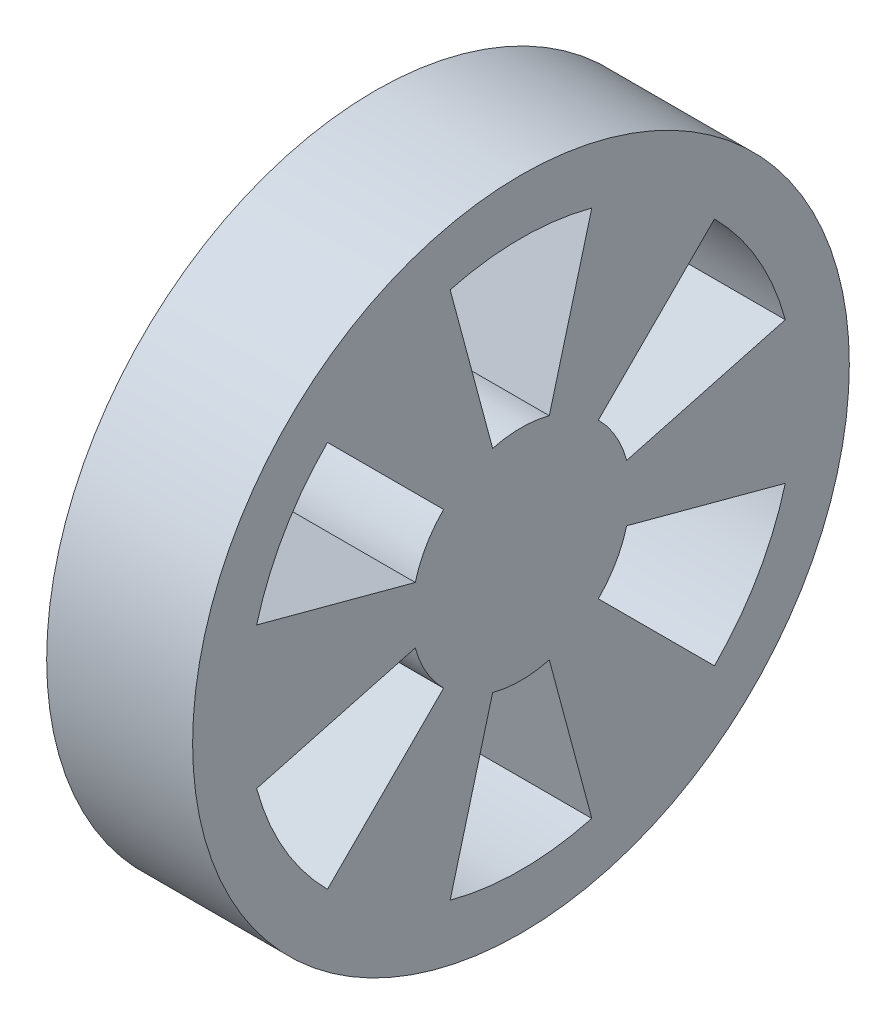
ISO-10303-21;
HEADER;
FILE_DESCRIPTION(('STEP AP214'),'2;1');
FILE_NAME('part.step','',(''),(''),'','','');
FILE_SCHEMA(('AUTOMOTIVE_DESIGN { 1 0 10303 214 1 1 1 1 }'));
ENDSEC;
DATA;
#1=APPLICATION_CONTEXT('core data for automotive mechanical design processes');
#2=APPLICATION_PROTOCOL_DEFINITION('international standard','automotive_design',2000,#1);
#3=PRODUCT_CONTEXT('',#1,'mechanical');
#4=PRODUCT('Part','Part','',(#3));
#5=PRODUCT_RELATED_PRODUCT_CATEGORY('part','',(#4));
#6=PRODUCT_DEFINITION_FORMATION('','',#4);
#7=PRODUCT_DEFINITION_CONTEXT('part definition',#1,'design');
#8=PRODUCT_DEFINITION('design','',#6,#7);
#9=PRODUCT_DEFINITION_SHAPE('','',#8);
#10=(LENGTH_UNIT() NAMED_UNIT(*) SI_UNIT(.MILLI.,.METRE.));
#11=(NAMED_UNIT(*) PLANE_ANGLE_UNIT() SI_UNIT($,.RADIAN.));
#12=(NAMED_UNIT(*) SI_UNIT($,.STERADIAN.) SOLID_ANGLE_UNIT());
#13=UNCERTAINTY_MEASURE_WITH_UNIT(LENGTH_MEASURE(1.E-05),#10,'distance_accuracy_value','');
#14=(GEOMETRIC_REPRESENTATION_CONTEXT(3) GLOBAL_UNCERTAINTY_ASSIGNED_CONTEXT((#13)) GLOBAL_UNIT_ASSIGNED_CONTEXT((#10,
#11,#12)) REPRESENTATION_CONTEXT('',''));
#15=CARTESIAN_POINT('',(0.,0.,0.));
#16=DIRECTION('',(0.,0.,1.));
#17=DIRECTION('',(1.,0.,0.));
#18=AXIS2_PLACEMENT_3D('',#15,#16,#17);
#19=CARTESIAN_POINT('',(20.,0.,0.));
#20=DIRECTION('',(-1.,0.,0.));
#21=DIRECTION('',(0.,0.,1.));
#22=AXIS2_PLACEMENT_3D('',#19,#20,#21);
#23=CYLINDRICAL_SURFACE('',#22,10.);
#24=CARTESIAN_POINT('',(20.,0.,0.));
#25=DIRECTION('',(1.,0.,0.));
#26=DIRECTION('',(0.,0.,-1.));
#27=AXIS2_PLACEMENT_3D('',#24,#25,#26);
#28=CIRCLE('',#27,10.);
#29=CARTESIAN_POINT('',(20.,0.,-10.));
#30=VERTEX_POINT('',#29);
#31=EDGE_CURVE('E11',#30,#30,#28,.T.);
#32=ORIENTED_EDGE('',*,*,#31,.F.);
#33=EDGE_LOOP('',(#32));
#34=FACE_BOUND('',#33,.T.);
#35=CARTESIAN_POINT('',(0.,0.,0.));
#36=DIRECTION('',(1.,0.,0.));
#37=DIRECTION('',(0.,0.,-1.));
#38=AXIS2_PLACEMENT_3D('',#35,#36,#37);
#39=CIRCLE('',#38,10.);
#40=CARTESIAN_POINT('',(0.,0.,-10.));
#41=VERTEX_POINT('',#40);
#42=EDGE_CURVE('E44',#41,#41,#39,.T.);
#43=ORIENTED_EDGE('',*,*,#42,.T.);
#44=EDGE_LOOP('',(#43));
#45=FACE_BOUND('',#44,.T.);
#46=ADVANCED_FACE('F41',(#34,#45),#23,.T.);
#47=CARTESIAN_POINT('',(0.,0.,0.));
#48=DIRECTION('',(1.,0.,0.));
#49=DIRECTION('',(0.,0.,-1.));
#50=AXIS2_PLACEMENT_3D('',#47,#48,#49);
#51=PLANE('',#50);
#52=ORIENTED_EDGE('',*,*,#42,.F.);
#53=EDGE_LOOP('',(#52));
#54=FACE_BOUND('',#53,.T.);
#55=ADVANCED_FACE('F502',(#54),#51,.F.);
#56=CARTESIAN_POINT('',(40.,0.,0.));
#57=DIRECTION('',(-1.,0.,0.));
#58=DIRECTION('',(0.,0.,1.));
#59=AXIS2_PLACEMENT_3D('',#56,#57,#58);
#60=CYLINDRICAL_SURFACE('',#59,45.);
#61=CARTESIAN_POINT('',(40.,0.,0.));
#62=DIRECTION('',(1.,0.,0.));
#63=DIRECTION('',(0.,0.,-1.));
#64=AXIS2_PLACEMENT_3D('',#61,#62,#63);
#65=CIRCLE('',#64,45.);
#66=CARTESIAN_POINT('',(40.,0.,-45.));
#67=VERTEX_POINT('',#66);
#68=EDGE_CURVE('E474',#67,#67,#65,.T.);
#69=ORIENTED_EDGE('',*,*,#68,.F.);
#70=EDGE_LOOP('',(#69));
#71=FACE_BOUND('',#70,.T.);
#72=CARTESIAN_POINT('',(20.,0.,0.));
#73=DIRECTION('',(1.,0.,0.));
#74=DIRECTION('',(0.,0.,-1.));
#75=AXIS2_PLACEMENT_3D('',#72,#73,#74);
#76=CIRCLE('',#75,45.);
#77=CARTESIAN_POINT('',(20.,0.,-45.));
#78=VERTEX_POINT('',#77);
#79=EDGE_CURVE('E464',#78,#78,#76,.T.);
#80=ORIENTED_EDGE('',*,*,#79,.T.);
#81=EDGE_LOOP('',(#80));
#82=FACE_BOUND('',#81,.T.);
#83=ADVANCED_FACE('F482',(#71,#82),#60,.T.);
#84=CARTESIAN_POINT('',(40.,0.,0.));
#85=DIRECTION('',(1.,0.,0.));
#86=DIRECTION('',(0.,0.,-1.));
#87=AXIS2_PLACEMENT_3D('',#84,#85,#86);
#88=PLANE('',#87);
#89=CARTESIAN_POINT('',(40.,0.,0.));
#90=DIRECTION('',(1.,0.,0.));
#91=DIRECTION('',(0.,0.,1.));
#92=AXIS2_PLACEMENT_3D('',#89,#90,#91);
#93=CIRCLE('',#92,15.);
#94=CARTESIAN_POINT('',(40.,10.6066017177982,10.6066017177982));
#95=VERTEX_POINT('',#94);
#96=CARTESIAN_POINT('',(40.,3.88228567653776,14.488887394336));
#97=VERTEX_POINT('',#96);
#98=EDGE_CURVE('E258',#95,#97,#93,.T.);
#99=ORIENTED_EDGE('',*,*,#98,.T.);
#100=DIRECTION('',(0.,0.258819045102518,0.965925826289069));
#101=VECTOR('',#100,1.);
#102=CARTESIAN_POINT('',(40.,9.70571419134441,36.2222184858401));
#103=LINE('',#102,#101);
#104=CARTESIAN_POINT('',(40.,9.70571419134441,36.2222184858401));
#105=VERTEX_POINT('',#104);
#106=EDGE_CURVE('E262',#97,#105,#103,.T.);
#107=ORIENTED_EDGE('',*,*,#106,.T.);
#108=CARTESIAN_POINT('',(40.,0.,0.));
#109=DIRECTION('',(-1.,0.,0.));
#110=DIRECTION('',(0.,0.,1.));
#111=AXIS2_PLACEMENT_3D('',#108,#109,#110);
#112=CIRCLE('',#111,37.5);
#113=CARTESIAN_POINT('',(40.,26.5165042944955,26.5165042944956));
#114=VERTEX_POINT('',#113);
#115=EDGE_CURVE('E56',#105,#114,#112,.T.);
#116=ORIENTED_EDGE('',*,*,#115,.T.);
#117=DIRECTION('',(0.,-0.707106781186547,-0.707106781186548));
#118=VECTOR('',#117,1.);
#119=CARTESIAN_POINT('',(40.,26.5165042944955,26.5165042944956));
#120=LINE('',#119,#118);
#121=EDGE_CURVE('E269',#114,#95,#120,.T.);
#122=ORIENTED_EDGE('',*,*,#121,.T.);
#123=EDGE_LOOP('',(#99,#107,#116,#122));
#124=FACE_BOUND('',#123,.T.);
#125=CARTESIAN_POINT('',(40.,0.,0.));
#126=DIRECTION('',(1.,0.,0.));
#127=DIRECTION('',(0.,0.,1.));
#128=AXIS2_PLACEMENT_3D('',#125,#126,#127);
#129=CIRCLE('',#128,15.);
#130=CARTESIAN_POINT('',(40.,-3.88228567653787,14.488887394336));
#131=VERTEX_POINT('',#130);
#132=CARTESIAN_POINT('',(40.,-10.6066017177983,10.6066017177982));
#133=VERTEX_POINT('',#132);
#134=EDGE_CURVE('E302',#131,#133,#129,.T.);
#135=ORIENTED_EDGE('',*,*,#134,.T.);
#136=DIRECTION('',(0.,-0.707106781186552,0.707106781186543));
#137=VECTOR('',#136,1.);
#138=CARTESIAN_POINT('',(40.,-26.5165042944957,26.5165042944954));
#139=LINE('',#138,#137);
#140=CARTESIAN_POINT('',(40.,-26.5165042944957,26.5165042944954));
#141=VERTEX_POINT('',#140);
#142=EDGE_CURVE('E306',#133,#141,#139,.T.);
#143=ORIENTED_EDGE('',*,*,#142,.T.);
#144=CARTESIAN_POINT('',(40.,0.,0.));
#145=DIRECTION('',(-1.,0.,0.));
#146=DIRECTION('',(0.,0.,1.));
#147=AXIS2_PLACEMENT_3D('',#144,#145,#146);
#148=CIRCLE('',#147,37.5);
#149=CARTESIAN_POINT('',(40.,-9.70571419134466,36.22221848584));
#150=VERTEX_POINT('',#149);
#151=EDGE_CURVE('E64',#141,#150,#148,.T.);
#152=ORIENTED_EDGE('',*,*,#151,.T.);
#153=DIRECTION('',(0.,0.258819045102524,-0.965925826289067));
#154=VECTOR('',#153,1.);
#155=CARTESIAN_POINT('',(40.,-9.70571419134466,36.22221848584));
#156=LINE('',#155,#154);
#157=EDGE_CURVE('E313',#150,#131,#156,.T.);
#158=ORIENTED_EDGE('',*,*,#157,.T.);
#159=EDGE_LOOP('',(#135,#143,#152,#158));
#160=FACE_BOUND('',#159,.T.);
#161=CARTESIAN_POINT('',(40.,0.,0.));
#162=DIRECTION('',(1.,0.,0.));
#163=DIRECTION('',(0.,0.,1.));
#164=AXIS2_PLACEMENT_3D('',#161,#162,#163);
#165=CIRCLE('',#164,15.);
#166=CARTESIAN_POINT('',(40.,-14.488887394336,3.88228567653772));
#167=VERTEX_POINT('',#166);
#168=CARTESIAN_POINT('',(40.,-14.488887394336,-3.88228567653793));
#169=VERTEX_POINT('',#168);
#170=EDGE_CURVE('E344',#167,#169,#165,.T.);
#171=ORIENTED_EDGE('',*,*,#170,.T.);
#172=DIRECTION('',(0.,-0.965925826289066,-0.258819045102529));
#173=VECTOR('',#172,1.);
#174=CARTESIAN_POINT('',(40.,-36.22221848584,-9.70571419134482));
#175=LINE('',#174,#173);
#176=CARTESIAN_POINT('',(40.,-36.22221848584,-9.70571419134482));
#177=VERTEX_POINT('',#176);
#178=EDGE_CURVE('E348',#169,#177,#175,.T.);
#179=ORIENTED_EDGE('',*,*,#178,.T.);
#180=CARTESIAN_POINT('',(40.,0.,0.));
#181=DIRECTION('',(-1.,0.,0.));
#182=DIRECTION('',(0.,0.,1.));
#183=AXIS2_PLACEMENT_3D('',#180,#181,#182);
#184=CIRCLE('',#183,37.5);
#185=CARTESIAN_POINT('',(40.,-36.2222184858401,9.70571419134432));
#186=VERTEX_POINT('',#185);
#187=EDGE_CURVE('E353',#177,#186,#184,.T.);
#188=ORIENTED_EDGE('',*,*,#187,.T.);
#189=DIRECTION('',(0.,0.96592582628907,-0.258819045102515));
#190=VECTOR('',#189,1.);
#191=CARTESIAN_POINT('',(40.,-36.2222184858401,9.70571419134431));
#192=LINE('',#191,#190);
#193=EDGE_CURVE('E357',#186,#167,#192,.T.);
#194=ORIENTED_EDGE('',*,*,#193,.T.);
#195=EDGE_LOOP('',(#171,#179,#188,#194));
#196=FACE_BOUND('',#195,.T.);
#197=CARTESIAN_POINT('',(40.,0.,0.));
#198=DIRECTION('',(1.,0.,0.));
#199=DIRECTION('',(0.,0.,1.));
#200=AXIS2_PLACEMENT_3D('',#197,#198,#199);
#201=CIRCLE('',#200,15.);
#202=CARTESIAN_POINT('',(40.,-10.6066017177981,-10.6066017177983));
#203=VERTEX_POINT('',#202);
#204=CARTESIAN_POINT('',(40.,-3.88228567653766,-14.4888873943361));
#205=VERTEX_POINT('',#204);
#206=EDGE_CURVE('E388',#203,#205,#201,.T.);
#207=ORIENTED_EDGE('',*,*,#206,.T.);
#208=DIRECTION('',(0.,-0.258819045102511,-0.965925826289071));
#209=VECTOR('',#208,1.);
#210=CARTESIAN_POINT('',(40.,-9.70571419134416,-36.2222184858402));
#211=LINE('',#210,#209);
#212=CARTESIAN_POINT('',(40.,-9.70571419134416,-36.2222184858402));
#213=VERTEX_POINT('',#212);
#214=EDGE_CURVE('E392',#205,#213,#211,.T.);
#215=ORIENTED_EDGE('',*,*,#214,.T.);
#216=CARTESIAN_POINT('',(40.,0.,0.));
#217=DIRECTION('',(-1.,0.,0.));
#218=DIRECTION('',(0.,0.,1.));
#219=AXIS2_PLACEMENT_3D('',#216,#217,#218);
#220=CIRCLE('',#219,37.5);
#221=CARTESIAN_POINT('',(40.,-26.5165042944953,-26.5165042944958));
#222=VERTEX_POINT('',#221);
#223=EDGE_CURVE('E397',#213,#222,#220,.T.);
#224=ORIENTED_EDGE('',*,*,#223,.T.);
#225=DIRECTION('',(0.,0.707106781186542,0.707106781186553));
#226=VECTOR('',#225,1.);
#227=CARTESIAN_POINT('',(40.,-26.5165042944953,-26.5165042944957));
#228=LINE('',#227,#226);
#229=EDGE_CURVE('E401',#222,#203,#228,.T.);
#230=ORIENTED_EDGE('',*,*,#229,.T.);
#231=EDGE_LOOP('',(#207,#215,#224,#230));
#232=FACE_BOUND('',#231,.T.);
#233=CARTESIAN_POINT('',(40.,0.,0.));
#234=DIRECTION('',(1.,0.,0.));
#235=DIRECTION('',(0.,0.,1.));
#236=AXIS2_PLACEMENT_3D('',#233,#234,#235);
#237=CIRCLE('',#236,15.);
#238=CARTESIAN_POINT('',(40.,3.88228567653797,-14.488887394336));
#239=VERTEX_POINT('',#238);
#240=CARTESIAN_POINT('',(40.,10.6066017177983,-10.6066017177981));
#241=VERTEX_POINT('',#240);
#242=EDGE_CURVE('E206',#239,#241,#237,.T.);
#243=ORIENTED_EDGE('',*,*,#242,.T.);
#244=DIRECTION('',(0.,0.707106781186557,-0.707106781186538));
#245=VECTOR('',#244,1.);
#246=CARTESIAN_POINT('',(40.,26.5165042944959,-26.5165042944952));
#247=LINE('',#246,#245);
#248=CARTESIAN_POINT('',(40.,26.5165042944959,-26.5165042944952));
#249=VERTEX_POINT('',#248);
#250=EDGE_CURVE('E219',#241,#249,#247,.T.);
#251=ORIENTED_EDGE('',*,*,#250,.T.);
#252=CARTESIAN_POINT('',(40.,0.,0.));
#253=DIRECTION('',(-1.,0.,0.));
#254=DIRECTION('',(0.,0.,1.));
#255=AXIS2_PLACEMENT_3D('',#252,#253,#254);
#256=CIRCLE('',#255,37.5);
#257=CARTESIAN_POINT('',(40.,9.70571419134491,-36.22221848584));
#258=VERTEX_POINT('',#257);
#259=EDGE_CURVE('E224',#249,#258,#256,.T.);
#260=ORIENTED_EDGE('',*,*,#259,.T.);
#261=DIRECTION('',(0.,-0.258819045102531,0.965925826289065));
#262=VECTOR('',#261,1.);
#263=CARTESIAN_POINT('',(40.,9.70571419134491,-36.22221848584));
#264=LINE('',#263,#262);
#265=EDGE_CURVE('E215',#258,#239,#264,.T.);
#266=ORIENTED_EDGE('',*,*,#265,.T.);
#267=EDGE_LOOP('',(#243,#251,#260,#266));
#268=FACE_BOUND('',#267,.T.);
#269=CARTESIAN_POINT('',(40.,0.,0.));
#270=DIRECTION('',(1.,0.,0.));
#271=DIRECTION('',(0.,0.,1.));
#272=AXIS2_PLACEMENT_3D('',#269,#270,#271);
#273=CIRCLE('',#272,15.);
#274=CARTESIAN_POINT('',(40.,14.488887394336,-3.88228567653782));
#275=VERTEX_POINT('',#274);
#276=CARTESIAN_POINT('',(40.,14.488887394336,3.88228567653782));
#277=VERTEX_POINT('',#276);
#278=EDGE_CURVE('E430',#275,#277,#273,.T.);
#279=ORIENTED_EDGE('',*,*,#278,.T.);
#280=DIRECTION('',(0.,0.965925826289068,0.258819045102522));
#281=VECTOR('',#280,1.);
#282=CARTESIAN_POINT('',(40.,36.2222184858401,9.70571419134456));
#283=LINE('',#282,#281);
#284=CARTESIAN_POINT('',(40.,36.2222184858401,9.70571419134456));
#285=VERTEX_POINT('',#284);
#286=EDGE_CURVE('E434',#277,#285,#283,.T.);
#287=ORIENTED_EDGE('',*,*,#286,.T.);
#288=CARTESIAN_POINT('',(40.,0.,0.));
#289=DIRECTION('',(-1.,0.,0.));
#290=DIRECTION('',(0.,0.,1.));
#291=AXIS2_PLACEMENT_3D('',#288,#289,#290);
#292=CIRCLE('',#291,37.5);
#293=CARTESIAN_POINT('',(40.,36.2222184858401,-9.70571419134456));
#294=VERTEX_POINT('',#293);
#295=EDGE_CURVE('E439',#285,#294,#292,.T.);
#296=ORIENTED_EDGE('',*,*,#295,.T.);
#297=DIRECTION('',(0.,-0.965925826289068,0.258819045102522));
#298=VECTOR('',#297,1.);
#299=CARTESIAN_POINT('',(40.,36.2222184858401,-9.70571419134456));
#300=LINE('',#299,#298);
#301=EDGE_CURVE('E443',#294,#275,#300,.T.);
#302=ORIENTED_EDGE('',*,*,#301,.T.);
#303=EDGE_LOOP('',(#279,#287,#296,#302));
#304=FACE_BOUND('',#303,.T.);
#305=ORIENTED_EDGE('',*,*,#68,.T.);
#306=EDGE_LOOP('',(#305));
#307=FACE_BOUND('',#306,.T.);
#308=ADVANCED_FACE('F226',(#124,#160,#196,#232,#268,#304,#307),#88,.T.);
#309=CARTESIAN_POINT('',(20.,0.,0.));
#310=DIRECTION('',(1.,0.,0.));
#311=DIRECTION('',(0.,0.,-1.));
#312=AXIS2_PLACEMENT_3D('',#309,#310,#311);
#313=PLANE('',#312);
#314=DIRECTION('',(0.,0.258819045102518,0.965925826289069));
#315=VECTOR('',#314,1.);
#316=CARTESIAN_POINT('',(20.,9.70571419134441,36.2222184858401));
#317=LINE('',#316,#315);
#318=CARTESIAN_POINT('',(20.,3.88228567653776,14.488887394336));
#319=VERTEX_POINT('',#318);
#320=CARTESIAN_POINT('',(20.,9.70571419134441,36.2222184858401));
#321=VERTEX_POINT('',#320);
#322=EDGE_CURVE('E277',#319,#321,#317,.T.);
#323=ORIENTED_EDGE('',*,*,#322,.F.);
#324=CARTESIAN_POINT('',(20.,0.,0.));
#325=DIRECTION('',(1.,0.,0.));
#326=DIRECTION('',(0.,0.,1.));
#327=AXIS2_PLACEMENT_3D('',#324,#325,#326);
#328=CIRCLE('',#327,15.);
#329=CARTESIAN_POINT('',(20.,10.6066017177982,10.6066017177982));
#330=VERTEX_POINT('',#329);
#331=EDGE_CURVE('E274',#330,#319,#328,.T.);
#332=ORIENTED_EDGE('',*,*,#331,.F.);
#333=DIRECTION('',(0.,-0.707106781186547,-0.707106781186548));
#334=VECTOR('',#333,1.);
#335=CARTESIAN_POINT('',(20.,26.5165042944955,26.5165042944956));
#336=LINE('',#335,#334);
#337=CARTESIAN_POINT('',(20.,26.5165042944955,26.5165042944956));
#338=VERTEX_POINT('',#337);
#339=EDGE_CURVE('E263',#338,#330,#336,.T.);
#340=ORIENTED_EDGE('',*,*,#339,.F.);
#341=CARTESIAN_POINT('',(20.,0.,0.));
#342=DIRECTION('',(-1.,0.,0.));
#343=DIRECTION('',(0.,0.,1.));
#344=AXIS2_PLACEMENT_3D('',#341,#342,#343);
#345=CIRCLE('',#344,37.5);
#346=EDGE_CURVE('E282',#321,#338,#345,.T.);
#347=ORIENTED_EDGE('',*,*,#346,.F.);
#348=EDGE_LOOP('',(#323,#332,#340,#347));
#349=FACE_BOUND('',#348,.T.);
#350=DIRECTION('',(0.,-0.707106781186552,0.707106781186543));
#351=VECTOR('',#350,1.);
#352=CARTESIAN_POINT('',(20.,-26.5165042944957,26.5165042944954));
#353=LINE('',#352,#351);
#354=CARTESIAN_POINT('',(20.,-10.6066017177983,10.6066017177982));
#355=VERTEX_POINT('',#354);
#356=CARTESIAN_POINT('',(20.,-26.5165042944957,26.5165042944954));
#357=VERTEX_POINT('',#356);
#358=EDGE_CURVE('E321',#355,#357,#353,.T.);
#359=ORIENTED_EDGE('',*,*,#358,.F.);
#360=CARTESIAN_POINT('',(20.,0.,0.));
#361=DIRECTION('',(1.,0.,0.));
#362=DIRECTION('',(0.,0.,1.));
#363=AXIS2_PLACEMENT_3D('',#360,#361,#362);
#364=CIRCLE('',#363,15.);
#365=CARTESIAN_POINT('',(20.,-3.88228567653787,14.488887394336));
#366=VERTEX_POINT('',#365);
#367=EDGE_CURVE('E318',#366,#355,#364,.T.);
#368=ORIENTED_EDGE('',*,*,#367,.F.);
#369=DIRECTION('',(0.,0.258819045102524,-0.965925826289067));
#370=VECTOR('',#369,1.);
#371=CARTESIAN_POINT('',(20.,-9.70571419134466,36.22221848584));
#372=LINE('',#371,#370);
#373=CARTESIAN_POINT('',(20.,-9.70571419134466,36.22221848584));
#374=VERTEX_POINT('',#373);
#375=EDGE_CURVE('E307',#374,#366,#372,.T.);
#376=ORIENTED_EDGE('',*,*,#375,.F.);
#377=CARTESIAN_POINT('',(20.,0.,0.));
#378=DIRECTION('',(-1.,0.,0.));
#379=DIRECTION('',(0.,0.,1.));
#380=AXIS2_PLACEMENT_3D('',#377,#378,#379);
#381=CIRCLE('',#380,37.5);
#382=EDGE_CURVE('E326',#357,#374,#381,.T.);
#383=ORIENTED_EDGE('',*,*,#382,.F.);
#384=EDGE_LOOP('',(#359,#368,#376,#383));
#385=FACE_BOUND('',#384,.T.);
#386=DIRECTION('',(0.,-0.965925826289066,-0.258819045102529));
#387=VECTOR('',#386,1.);
#388=CARTESIAN_POINT('',(20.,-36.22221848584,-9.70571419134482));
#389=LINE('',#388,#387);
#390=CARTESIAN_POINT('',(20.,-14.488887394336,-3.88228567653793));
#391=VERTEX_POINT('',#390);
#392=CARTESIAN_POINT('',(20.,-36.22221848584,-9.70571419134482));
#393=VERTEX_POINT('',#392);
#394=EDGE_CURVE('E365',#391,#393,#389,.T.);
#395=ORIENTED_EDGE('',*,*,#394,.F.);
#396=CARTESIAN_POINT('',(20.,0.,0.));
#397=DIRECTION('',(1.,0.,0.));
#398=DIRECTION('',(0.,0.,1.));
#399=AXIS2_PLACEMENT_3D('',#396,#397,#398);
#400=CIRCLE('',#399,15.);
#401=CARTESIAN_POINT('',(20.,-14.488887394336,3.88228567653772));
#402=VERTEX_POINT('',#401);
#403=EDGE_CURVE('E362',#402,#391,#400,.T.);
#404=ORIENTED_EDGE('',*,*,#403,.F.);
#405=DIRECTION('',(0.,0.96592582628907,-0.258819045102515));
#406=VECTOR('',#405,1.);
#407=CARTESIAN_POINT('',(20.,-36.2222184858401,9.70571419134431));
#408=LINE('',#407,#406);
#409=CARTESIAN_POINT('',(20.,-36.2222184858401,9.70571419134432));
#410=VERTEX_POINT('',#409);
#411=EDGE_CURVE('E349',#410,#402,#408,.T.);
#412=ORIENTED_EDGE('',*,*,#411,.F.);
#413=CARTESIAN_POINT('',(20.,0.,0.));
#414=DIRECTION('',(-1.,0.,0.));
#415=DIRECTION('',(0.,0.,1.));
#416=AXIS2_PLACEMENT_3D('',#413,#414,#415);
#417=CIRCLE('',#416,37.5);
#418=EDGE_CURVE('E370',#393,#410,#417,.T.);
#419=ORIENTED_EDGE('',*,*,#418,.F.);
#420=EDGE_LOOP('',(#395,#404,#412,#419));
#421=FACE_BOUND('',#420,.T.);
#422=DIRECTION('',(0.,-0.258819045102511,-0.965925826289071));
#423=VECTOR('',#422,1.);
#424=CARTESIAN_POINT('',(20.,-9.70571419134416,-36.2222184858402));
#425=LINE('',#424,#423);
#426=CARTESIAN_POINT('',(20.,-3.88228567653767,-14.4888873943361));
#427=VERTEX_POINT('',#426);
#428=CARTESIAN_POINT('',(20.,-9.70571419134416,-36.2222184858402));
#429=VERTEX_POINT('',#428);
#430=EDGE_CURVE('E408',#427,#429,#425,.T.);
#431=ORIENTED_EDGE('',*,*,#430,.F.);
#432=CARTESIAN_POINT('',(20.,0.,0.));
#433=DIRECTION('',(1.,0.,0.));
#434=DIRECTION('',(0.,0.,1.));
#435=AXIS2_PLACEMENT_3D('',#432,#433,#434);
#436=CIRCLE('',#435,15.);
#437=CARTESIAN_POINT('',(20.,-10.6066017177981,-10.6066017177983));
#438=VERTEX_POINT('',#437);
#439=EDGE_CURVE('E252',#438,#427,#436,.T.);
#440=ORIENTED_EDGE('',*,*,#439,.F.);
#441=DIRECTION('',(0.,0.707106781186542,0.707106781186553));
#442=VECTOR('',#441,1.);
#443=CARTESIAN_POINT('',(20.,-26.5165042944953,-26.5165042944957));
#444=LINE('',#443,#442);
#445=CARTESIAN_POINT('',(20.,-26.5165042944953,-26.5165042944958));
#446=VERTEX_POINT('',#445);
#447=EDGE_CURVE('E393',#446,#438,#444,.T.);
#448=ORIENTED_EDGE('',*,*,#447,.F.);
#449=CARTESIAN_POINT('',(20.,0.,0.));
#450=DIRECTION('',(-1.,0.,0.));
#451=DIRECTION('',(0.,0.,1.));
#452=AXIS2_PLACEMENT_3D('',#449,#450,#451);
#453=CIRCLE('',#452,37.5);
#454=EDGE_CURVE('E412',#429,#446,#453,.T.);
#455=ORIENTED_EDGE('',*,*,#454,.F.);
#456=EDGE_LOOP('',(#431,#440,#448,#455));
#457=FACE_BOUND('',#456,.T.);
#458=DIRECTION('',(0.,0.707106781186557,-0.707106781186538));
#459=VECTOR('',#458,1.);
#460=CARTESIAN_POINT('',(20.,26.5165042944959,-26.5165042944952));
#461=LINE('',#460,#459);
#462=CARTESIAN_POINT('',(20.,10.6066017177983,-10.6066017177981));
#463=VERTEX_POINT('',#462);
#464=CARTESIAN_POINT('',(20.,26.5165042944959,-26.5165042944952));
#465=VERTEX_POINT('',#464);
#466=EDGE_CURVE('E243',#463,#465,#461,.T.);
#467=ORIENTED_EDGE('',*,*,#466,.F.);
#468=CARTESIAN_POINT('',(20.,0.,0.));
#469=DIRECTION('',(1.,0.,0.));
#470=DIRECTION('',(0.,0.,1.));
#471=AXIS2_PLACEMENT_3D('',#468,#469,#470);
#472=CIRCLE('',#471,15.);
#473=CARTESIAN_POINT('',(20.,3.88228567653797,-14.488887394336));
#474=VERTEX_POINT('',#473);
#475=EDGE_CURVE('E209',#474,#463,#472,.T.);
#476=ORIENTED_EDGE('',*,*,#475,.F.);
#477=DIRECTION('',(0.,-0.258819045102531,0.965925826289065));
#478=VECTOR('',#477,1.);
#479=CARTESIAN_POINT('',(20.,9.70571419134491,-36.22221848584));
#480=LINE('',#479,#478);
#481=CARTESIAN_POINT('',(20.,9.70571419134491,-36.22221848584));
#482=VERTEX_POINT('',#481);
#483=EDGE_CURVE('E230',#482,#474,#480,.T.);
#484=ORIENTED_EDGE('',*,*,#483,.F.);
#485=CARTESIAN_POINT('',(20.,0.,0.));
#486=DIRECTION('',(-1.,0.,0.));
#487=DIRECTION('',(0.,0.,1.));
#488=AXIS2_PLACEMENT_3D('',#485,#486,#487);
#489=CIRCLE('',#488,37.5);
#490=EDGE_CURVE('E234',#465,#482,#489,.T.);
#491=ORIENTED_EDGE('',*,*,#490,.F.);
#492=EDGE_LOOP('',(#467,#476,#484,#491));
#493=FACE_BOUND('',#492,.T.);
#494=DIRECTION('',(0.,0.965925826289068,0.258819045102522));
#495=VECTOR('',#494,1.);
#496=CARTESIAN_POINT('',(20.,36.2222184858401,9.70571419134456));
#497=LINE('',#496,#495);
#498=CARTESIAN_POINT('',(20.,14.488887394336,3.88228567653782));
#499=VERTEX_POINT('',#498);
#500=CARTESIAN_POINT('',(20.,36.2222184858401,9.70571419134456));
#501=VERTEX_POINT('',#500);
#502=EDGE_CURVE('E450',#499,#501,#497,.T.);
#503=ORIENTED_EDGE('',*,*,#502,.F.);
#504=CARTESIAN_POINT('',(20.,0.,0.));
#505=DIRECTION('',(1.,0.,0.));
#506=DIRECTION('',(0.,0.,1.));
#507=AXIS2_PLACEMENT_3D('',#504,#505,#506);
#508=CIRCLE('',#507,15.);
#509=CARTESIAN_POINT('',(20.,14.488887394336,-3.88228567653782));
#510=VERTEX_POINT('',#509);
#511=EDGE_CURVE('E292',#510,#499,#508,.T.);
#512=ORIENTED_EDGE('',*,*,#511,.F.);
#513=DIRECTION('',(0.,-0.965925826289068,0.258819045102522));
#514=VECTOR('',#513,1.);
#515=CARTESIAN_POINT('',(20.,36.2222184858401,-9.70571419134456));
#516=LINE('',#515,#514);
#517=CARTESIAN_POINT('',(20.,36.2222184858401,-9.70571419134456));
#518=VERTEX_POINT('',#517);
#519=EDGE_CURVE('E435',#518,#510,#516,.T.);
#520=ORIENTED_EDGE('',*,*,#519,.F.);
#521=CARTESIAN_POINT('',(20.,0.,0.));
#522=DIRECTION('',(-1.,0.,0.));
#523=DIRECTION('',(0.,0.,1.));
#524=AXIS2_PLACEMENT_3D('',#521,#522,#523);
#525=CIRCLE('',#524,37.5);
#526=EDGE_CURVE('E454',#501,#518,#525,.T.);
#527=ORIENTED_EDGE('',*,*,#526,.F.);
#528=EDGE_LOOP('',(#503,#512,#520,#527));
#529=FACE_BOUND('',#528,.T.);
#530=ORIENTED_EDGE('',*,*,#31,.T.);
#531=EDGE_LOOP('',(#530));
#532=FACE_BOUND('',#531,.T.);
#533=ORIENTED_EDGE('',*,*,#79,.F.);
#534=EDGE_LOOP('',(#533));
#535=FACE_BOUND('',#534,.T.);
#536=ADVANCED_FACE('F484',(#349,#385,#421,#457,#493,#529,#532,#535),#313,.F.);
#537=CARTESIAN_POINT('',(40.,0.,0.));
#538=DIRECTION('',(-1.,0.,0.));
#539=DIRECTION('',(0.,0.,1.));
#540=AXIS2_PLACEMENT_3D('',#537,#538,#539);
#541=CYLINDRICAL_SURFACE('',#540,15.);
#542=ORIENTED_EDGE('',*,*,#511,.T.);
#543=DIRECTION('',(-1.,0.,0.));
#544=VECTOR('',#543,1.);
#545=CARTESIAN_POINT('',(40.,14.488887394336,3.88228567653782));
#546=LINE('',#545,#544);
#547=EDGE_CURVE('E447',#277,#499,#546,.T.);
#548=ORIENTED_EDGE('',*,*,#547,.F.);
#549=ORIENTED_EDGE('',*,*,#278,.F.);
#550=DIRECTION('',(-1.,0.,0.));
#551=VECTOR('',#550,1.);
#552=CARTESIAN_POINT('',(40.,14.488887394336,-3.88228567653782));
#553=LINE('',#552,#551);
#554=EDGE_CURVE('E461',#275,#510,#553,.T.);
#555=ORIENTED_EDGE('',*,*,#554,.T.);
#556=EDGE_LOOP('',(#542,#548,#549,#555));
#557=FACE_BOUND('',#556,.T.);
#558=ADVANCED_FACE('F486',(#557),#541,.T.);
#559=CARTESIAN_POINT('',(40.,36.2222184858401,-9.70571419134456));
#560=DIRECTION('',(0.,-0.258819045102522,-0.965925826289068));
#561=DIRECTION('',(0.,0.965925826289068,-0.258819045102522));
#562=AXIS2_PLACEMENT_3D('',#559,#560,#561);
#563=PLANE('',#562);
#564=ORIENTED_EDGE('',*,*,#519,.T.);
#565=ORIENTED_EDGE('',*,*,#554,.F.);
#566=ORIENTED_EDGE('',*,*,#301,.F.);
#567=DIRECTION('',(-1.,0.,0.));
#568=VECTOR('',#567,1.);
#569=CARTESIAN_POINT('',(40.,36.2222184858401,-9.70571419134456));
#570=LINE('',#569,#568);
#571=EDGE_CURVE('E465',#294,#518,#570,.T.);
#572=ORIENTED_EDGE('',*,*,#571,.T.);
#573=EDGE_LOOP('',(#564,#565,#566,#572));
#574=FACE_BOUND('',#573,.T.);
#575=ADVANCED_FACE('F493',(#574),#563,.F.);
#576=CARTESIAN_POINT('',(40.,0.,0.));
#577=DIRECTION('',(-1.,0.,0.));
#578=DIRECTION('',(0.,0.,1.));
#579=AXIS2_PLACEMENT_3D('',#576,#577,#578);
#580=CYLINDRICAL_SURFACE('',#579,37.5);
#581=ORIENTED_EDGE('',*,*,#526,.T.);
#582=ORIENTED_EDGE('',*,*,#571,.F.);
#583=ORIENTED_EDGE('',*,*,#295,.F.);
#584=DIRECTION('',(-1.,0.,0.));
#585=VECTOR('',#584,1.);
#586=CARTESIAN_POINT('',(40.,36.2222184858401,9.70571419134456));
#587=LINE('',#586,#585);
#588=EDGE_CURVE('E468',#285,#501,#587,.T.);
#589=ORIENTED_EDGE('',*,*,#588,.T.);
#590=EDGE_LOOP('',(#581,#582,#583,#589));
#591=FACE_BOUND('',#590,.T.);
#592=ADVANCED_FACE('F545',(#591),#580,.F.);
#593=CARTESIAN_POINT('',(40.,36.2222184858401,9.70571419134456));
#594=DIRECTION('',(0.,-0.258819045102522,0.965925826289068));
#595=DIRECTION('',(0.,-0.965925826289068,-0.258819045102522));
#596=AXIS2_PLACEMENT_3D('',#593,#594,#595);
#597=PLANE('',#596);
#598=ORIENTED_EDGE('',*,*,#502,.T.);
#599=ORIENTED_EDGE('',*,*,#588,.F.);
#600=ORIENTED_EDGE('',*,*,#286,.F.);
#601=ORIENTED_EDGE('',*,*,#547,.T.);
#602=EDGE_LOOP('',(#598,#599,#600,#601));
#603=FACE_BOUND('',#602,.T.);
#604=ADVANCED_FACE('F555',(#603),#597,.F.);
#605=CARTESIAN_POINT('',(40.,0.,0.));
#606=DIRECTION('',(-1.,0.,0.));
#607=DIRECTION('',(0.,0.,1.));
#608=AXIS2_PLACEMENT_3D('',#605,#606,#607);
#609=CYLINDRICAL_SURFACE('',#608,15.);
#610=ORIENTED_EDGE('',*,*,#475,.T.);
#611=DIRECTION('',(-1.,0.,0.));
#612=VECTOR('',#611,1.);
#613=CARTESIAN_POINT('',(40.,10.6066017177983,-10.6066017177981));
#614=LINE('',#613,#612);
#615=EDGE_CURVE('E202',#241,#463,#614,.T.);
#616=ORIENTED_EDGE('',*,*,#615,.F.);
#617=ORIENTED_EDGE('',*,*,#242,.F.);
#618=DIRECTION('',(-1.,0.,0.));
#619=VECTOR('',#618,1.);
#620=CARTESIAN_POINT('',(40.,3.88228567653797,-14.488887394336));
#621=LINE('',#620,#619);
#622=EDGE_CURVE('E249',#239,#474,#621,.T.);
#623=ORIENTED_EDGE('',*,*,#622,.T.);
#624=EDGE_LOOP('',(#610,#616,#617,#623));
#625=FACE_BOUND('',#624,.T.);
#626=ADVANCED_FACE('F204',(#625),#609,.T.);
#627=CARTESIAN_POINT('',(40.,9.70571419134491,-36.22221848584));
#628=DIRECTION('',(0.,-0.965925826289066,-0.258819045102531));
#629=DIRECTION('',(0.,0.258819045102531,-0.965925826289066));
#630=AXIS2_PLACEMENT_3D('',#627,#628,#629);
#631=PLANE('',#630);
#632=ORIENTED_EDGE('',*,*,#483,.T.);
#633=ORIENTED_EDGE('',*,*,#622,.F.);
#634=ORIENTED_EDGE('',*,*,#265,.F.);
#635=DIRECTION('',(-1.,0.,0.));
#636=VECTOR('',#635,1.);
#637=CARTESIAN_POINT('',(40.,9.70571419134491,-36.22221848584));
#638=LINE('',#637,#636);
#639=EDGE_CURVE('E253',#258,#482,#638,.T.);
#640=ORIENTED_EDGE('',*,*,#639,.T.);
#641=EDGE_LOOP('',(#632,#633,#634,#640));
#642=FACE_BOUND('',#641,.T.);
#643=ADVANCED_FACE('F574',(#642),#631,.F.);
#644=CARTESIAN_POINT('',(40.,0.,0.));
#645=DIRECTION('',(-1.,0.,0.));
#646=DIRECTION('',(0.,0.,1.));
#647=AXIS2_PLACEMENT_3D('',#644,#645,#646);
#648=CYLINDRICAL_SURFACE('',#647,37.5);
#649=ORIENTED_EDGE('',*,*,#490,.T.);
#650=ORIENTED_EDGE('',*,*,#639,.F.);
#651=ORIENTED_EDGE('',*,*,#259,.F.);
#652=DIRECTION('',(-1.,0.,0.));
#653=VECTOR('',#652,1.);
#654=CARTESIAN_POINT('',(40.,26.5165042944959,-26.5165042944952));
#655=LINE('',#654,#653);
#656=EDGE_CURVE('E214',#249,#465,#655,.T.);
#657=ORIENTED_EDGE('',*,*,#656,.T.);
#658=EDGE_LOOP('',(#649,#650,#651,#657));
#659=FACE_BOUND('',#658,.T.);
#660=ADVANCED_FACE('F583',(#659),#648,.F.);
#661=CARTESIAN_POINT('',(40.,26.5165042944959,-26.5165042944952));
#662=DIRECTION('',(0.,0.707106781186538,0.707106781186557));
#663=DIRECTION('',(0.,-0.707106781186557,0.707106781186538));
#664=AXIS2_PLACEMENT_3D('',#661,#662,#663);
#665=PLANE('',#664);
#666=ORIENTED_EDGE('',*,*,#466,.T.);
#667=ORIENTED_EDGE('',*,*,#656,.F.);
#668=ORIENTED_EDGE('',*,*,#250,.F.);
#669=ORIENTED_EDGE('',*,*,#615,.T.);
#670=EDGE_LOOP('',(#666,#667,#668,#669));
#671=FACE_BOUND('',#670,.T.);
#672=ADVANCED_FACE('F220',(#671),#665,.F.);
#673=CARTESIAN_POINT('',(40.,0.,0.));
#674=DIRECTION('',(-1.,0.,0.));
#675=DIRECTION('',(0.,0.,1.));
#676=AXIS2_PLACEMENT_3D('',#673,#674,#675);
#677=CYLINDRICAL_SURFACE('',#676,15.);
#678=ORIENTED_EDGE('',*,*,#439,.T.);
#679=DIRECTION('',(-1.,0.,0.));
#680=VECTOR('',#679,1.);
#681=CARTESIAN_POINT('',(40.,-3.88228567653766,-14.4888873943361));
#682=LINE('',#681,#680);
#683=EDGE_CURVE('E405',#205,#427,#682,.T.);
#684=ORIENTED_EDGE('',*,*,#683,.F.);
#685=ORIENTED_EDGE('',*,*,#206,.F.);
#686=DIRECTION('',(-1.,0.,0.));
#687=VECTOR('',#686,1.);
#688=CARTESIAN_POINT('',(40.,-10.6066017177981,-10.6066017177983));
#689=LINE('',#688,#687);
#690=EDGE_CURVE('E366',#203,#438,#689,.T.);
#691=ORIENTED_EDGE('',*,*,#690,.T.);
#692=EDGE_LOOP('',(#678,#684,#685,#691));
#693=FACE_BOUND('',#692,.T.);
#694=ADVANCED_FACE('F602',(#693),#677,.T.);
#695=CARTESIAN_POINT('',(40.,-26.5165042944953,-26.5165042944957));
#696=DIRECTION('',(0.,-0.707106781186553,0.707106781186542));
#697=DIRECTION('',(0.,-0.707106781186542,-0.707106781186553));
#698=AXIS2_PLACEMENT_3D('',#695,#696,#697);
#699=PLANE('',#698);
#700=ORIENTED_EDGE('',*,*,#447,.T.);
#701=ORIENTED_EDGE('',*,*,#690,.F.);
#702=ORIENTED_EDGE('',*,*,#229,.F.);
#703=DIRECTION('',(-1.,0.,0.));
#704=VECTOR('',#703,1.);
#705=CARTESIAN_POINT('',(40.,-26.5165042944953,-26.5165042944958));
#706=LINE('',#705,#704);
#707=EDGE_CURVE('E421',#222,#446,#706,.T.);
#708=ORIENTED_EDGE('',*,*,#707,.T.);
#709=EDGE_LOOP('',(#700,#701,#702,#708));
#710=FACE_BOUND('',#709,.T.);
#711=ADVANCED_FACE('F611',(#710),#699,.F.);
#712=CARTESIAN_POINT('',(40.,0.,0.));
#713=DIRECTION('',(-1.,0.,0.));
#714=DIRECTION('',(0.,0.,1.));
#715=AXIS2_PLACEMENT_3D('',#712,#713,#714);
#716=CYLINDRICAL_SURFACE('',#715,37.5);
#717=ORIENTED_EDGE('',*,*,#454,.T.);
#718=ORIENTED_EDGE('',*,*,#707,.F.);
#719=ORIENTED_EDGE('',*,*,#223,.F.);
#720=DIRECTION('',(-1.,0.,0.));
#721=VECTOR('',#720,1.);
#722=CARTESIAN_POINT('',(40.,-9.70571419134416,-36.2222184858402));
#723=LINE('',#722,#721);
#724=EDGE_CURVE('E424',#213,#429,#723,.T.);
#725=ORIENTED_EDGE('',*,*,#724,.T.);
#726=EDGE_LOOP('',(#717,#718,#719,#725));
#727=FACE_BOUND('',#726,.T.);
#728=ADVANCED_FACE('F621',(#727),#716,.F.);
#729=CARTESIAN_POINT('',(40.,-9.70571419134416,-36.2222184858402));
#730=DIRECTION('',(0.,0.965925826289071,-0.258819045102511));
#731=DIRECTION('',(0.,0.258819045102511,0.965925826289071));
#732=AXIS2_PLACEMENT_3D('',#729,#730,#731);
#733=PLANE('',#732);
#734=ORIENTED_EDGE('',*,*,#430,.T.);
#735=ORIENTED_EDGE('',*,*,#724,.F.);
#736=ORIENTED_EDGE('',*,*,#214,.F.);
#737=ORIENTED_EDGE('',*,*,#683,.T.);
#738=EDGE_LOOP('',(#734,#735,#736,#737));
#739=FACE_BOUND('',#738,.T.);
#740=ADVANCED_FACE('F631',(#739),#733,.F.);
#741=CARTESIAN_POINT('',(40.,0.,0.));
#742=DIRECTION('',(-1.,0.,0.));
#743=DIRECTION('',(0.,0.,1.));
#744=AXIS2_PLACEMENT_3D('',#741,#742,#743);
#745=CYLINDRICAL_SURFACE('',#744,15.);
#746=ORIENTED_EDGE('',*,*,#403,.T.);
#747=DIRECTION('',(-1.,0.,0.));
#748=VECTOR('',#747,1.);
#749=CARTESIAN_POINT('',(40.,-14.488887394336,-3.88228567653793));
#750=LINE('',#749,#748);
#751=EDGE_CURVE('E361',#169,#391,#750,.T.);
#752=ORIENTED_EDGE('',*,*,#751,.F.);
#753=ORIENTED_EDGE('',*,*,#170,.F.);
#754=DIRECTION('',(-1.,0.,0.));
#755=VECTOR('',#754,1.);
#756=CARTESIAN_POINT('',(40.,-14.488887394336,3.88228567653772));
#757=LINE('',#756,#755);
#758=EDGE_CURVE('E322',#167,#402,#757,.T.);
#759=ORIENTED_EDGE('',*,*,#758,.T.);
#760=EDGE_LOOP('',(#746,#752,#753,#759));
#761=FACE_BOUND('',#760,.T.);
#762=ADVANCED_FACE('F641',(#761),#745,.T.);
#763=CARTESIAN_POINT('',(40.,-36.2222184858401,9.70571419134431));
#764=DIRECTION('',(0.,0.258819045102515,0.96592582628907));
#765=DIRECTION('',(0.,-0.96592582628907,0.258819045102515));
#766=AXIS2_PLACEMENT_3D('',#763,#764,#765);
#767=PLANE('',#766);
#768=ORIENTED_EDGE('',*,*,#411,.T.);
#769=ORIENTED_EDGE('',*,*,#758,.F.);
#770=ORIENTED_EDGE('',*,*,#193,.F.);
#771=DIRECTION('',(-1.,0.,0.));
#772=VECTOR('',#771,1.);
#773=CARTESIAN_POINT('',(40.,-36.2222184858401,9.70571419134432));
#774=LINE('',#773,#772);
#775=EDGE_CURVE('E379',#186,#410,#774,.T.);
#776=ORIENTED_EDGE('',*,*,#775,.T.);
#777=EDGE_LOOP('',(#768,#769,#770,#776));
#778=FACE_BOUND('',#777,.T.);
#779=ADVANCED_FACE('F651',(#778),#767,.F.);
#780=CARTESIAN_POINT('',(40.,0.,0.));
#781=DIRECTION('',(-1.,0.,0.));
#782=DIRECTION('',(0.,0.,1.));
#783=AXIS2_PLACEMENT_3D('',#780,#781,#782);
#784=CYLINDRICAL_SURFACE('',#783,37.5);
#785=ORIENTED_EDGE('',*,*,#418,.T.);
#786=ORIENTED_EDGE('',*,*,#775,.F.);
#787=ORIENTED_EDGE('',*,*,#187,.F.);
#788=DIRECTION('',(-1.,0.,0.));
#789=VECTOR('',#788,1.);
#790=CARTESIAN_POINT('',(40.,-36.22221848584,-9.70571419134482));
#791=LINE('',#790,#789);
#792=EDGE_CURVE('E382',#177,#393,#791,.T.);
#793=ORIENTED_EDGE('',*,*,#792,.T.);
#794=EDGE_LOOP('',(#785,#786,#787,#793));
#795=FACE_BOUND('',#794,.T.);
#796=ADVANCED_FACE('F661',(#795),#784,.F.);
#797=CARTESIAN_POINT('',(40.,-36.22221848584,-9.70571419134482));
#798=DIRECTION('',(0.,0.258819045102529,-0.965925826289066));
#799=DIRECTION('',(0.,0.965925826289066,0.258819045102529));
#800=AXIS2_PLACEMENT_3D('',#797,#798,#799);
#801=PLANE('',#800);
#802=ORIENTED_EDGE('',*,*,#394,.T.);
#803=ORIENTED_EDGE('',*,*,#792,.F.);
#804=ORIENTED_EDGE('',*,*,#178,.F.);
#805=ORIENTED_EDGE('',*,*,#751,.T.);
#806=EDGE_LOOP('',(#802,#803,#804,#805));
#807=FACE_BOUND('',#806,.T.);
#808=ADVANCED_FACE('F671',(#807),#801,.F.);
#809=CARTESIAN_POINT('',(40.,0.,0.));
#810=DIRECTION('',(-1.,0.,0.));
#811=DIRECTION('',(0.,0.,1.));
#812=AXIS2_PLACEMENT_3D('',#809,#810,#811);
#813=CYLINDRICAL_SURFACE('',#812,15.);
#814=ORIENTED_EDGE('',*,*,#367,.T.);
#815=DIRECTION('',(-1.,0.,0.));
#816=VECTOR('',#815,1.);
#817=CARTESIAN_POINT('',(40.,-10.6066017177983,10.6066017177982));
#818=LINE('',#817,#816);
#819=EDGE_CURVE('E317',#133,#355,#818,.T.);
#820=ORIENTED_EDGE('',*,*,#819,.F.);
#821=ORIENTED_EDGE('',*,*,#134,.F.);
#822=DIRECTION('',(-1.,0.,0.));
#823=VECTOR('',#822,1.);
#824=CARTESIAN_POINT('',(40.,-3.88228567653787,14.488887394336));
#825=LINE('',#824,#823);
#826=EDGE_CURVE('E278',#131,#366,#825,.T.);
#827=ORIENTED_EDGE('',*,*,#826,.T.);
#828=EDGE_LOOP('',(#814,#820,#821,#827));
#829=FACE_BOUND('',#828,.T.);
#830=ADVANCED_FACE('F681',(#829),#813,.T.);
#831=CARTESIAN_POINT('',(40.,-9.70571419134466,36.22221848584));
#832=DIRECTION('',(0.,0.965925826289067,0.258819045102524));
#833=DIRECTION('',(0.,-0.258819045102524,0.965925826289067));
#834=AXIS2_PLACEMENT_3D('',#831,#832,#833);
#835=PLANE('',#834);
#836=ORIENTED_EDGE('',*,*,#375,.T.);
#837=ORIENTED_EDGE('',*,*,#826,.F.);
#838=ORIENTED_EDGE('',*,*,#157,.F.);
#839=DIRECTION('',(-1.,0.,0.));
#840=VECTOR('',#839,1.);
#841=CARTESIAN_POINT('',(40.,-9.70571419134466,36.22221848584));
#842=LINE('',#841,#840);
#843=EDGE_CURVE('E335',#150,#374,#842,.T.);
#844=ORIENTED_EDGE('',*,*,#843,.T.);
#845=EDGE_LOOP('',(#836,#837,#838,#844));
#846=FACE_BOUND('',#845,.T.);
#847=ADVANCED_FACE('F691',(#846),#835,.F.);
#848=CARTESIAN_POINT('',(40.,0.,0.));
#849=DIRECTION('',(-1.,0.,0.));
#850=DIRECTION('',(0.,0.,1.));
#851=AXIS2_PLACEMENT_3D('',#848,#849,#850);
#852=CYLINDRICAL_SURFACE('',#851,37.5);
#853=ORIENTED_EDGE('',*,*,#382,.T.);
#854=ORIENTED_EDGE('',*,*,#843,.F.);
#855=ORIENTED_EDGE('',*,*,#151,.F.);
#856=DIRECTION('',(-1.,0.,0.));
#857=VECTOR('',#856,1.);
#858=CARTESIAN_POINT('',(40.,-26.5165042944957,26.5165042944954));
#859=LINE('',#858,#857);
#860=EDGE_CURVE('E338',#141,#357,#859,.T.);
#861=ORIENTED_EDGE('',*,*,#860,.T.);
#862=EDGE_LOOP('',(#853,#854,#855,#861));
#863=FACE_BOUND('',#862,.T.);
#864=ADVANCED_FACE('F701',(#863),#852,.F.);
#865=CARTESIAN_POINT('',(40.,-26.5165042944957,26.5165042944954));
#866=DIRECTION('',(0.,-0.707106781186543,-0.707106781186552));
#867=DIRECTION('',(0.,0.707106781186552,-0.707106781186543));
#868=AXIS2_PLACEMENT_3D('',#865,#866,#867);
#869=PLANE('',#868);
#870=ORIENTED_EDGE('',*,*,#358,.T.);
#871=ORIENTED_EDGE('',*,*,#860,.F.);
#872=ORIENTED_EDGE('',*,*,#142,.F.);
#873=ORIENTED_EDGE('',*,*,#819,.T.);
#874=EDGE_LOOP('',(#870,#871,#872,#873));
#875=FACE_BOUND('',#874,.T.);
#876=ADVANCED_FACE('F711',(#875),#869,.F.);
#877=CARTESIAN_POINT('',(40.,0.,0.));
#878=DIRECTION('',(-1.,0.,0.));
#879=DIRECTION('',(0.,0.,1.));
#880=AXIS2_PLACEMENT_3D('',#877,#878,#879);
#881=CYLINDRICAL_SURFACE('',#880,15.);
#882=ORIENTED_EDGE('',*,*,#331,.T.);
#883=DIRECTION('',(-1.,0.,0.));
#884=VECTOR('',#883,1.);
#885=CARTESIAN_POINT('',(40.,3.88228567653776,14.488887394336));
#886=LINE('',#885,#884);
#887=EDGE_CURVE('E273',#97,#319,#886,.T.);
#888=ORIENTED_EDGE('',*,*,#887,.F.);
#889=ORIENTED_EDGE('',*,*,#98,.F.);
#890=DIRECTION('',(-1.,0.,0.));
#891=VECTOR('',#890,1.);
#892=CARTESIAN_POINT('',(40.,10.6066017177982,10.6066017177982));
#893=LINE('',#892,#891);
#894=EDGE_CURVE('E289',#95,#330,#893,.T.);
#895=ORIENTED_EDGE('',*,*,#894,.T.);
#896=EDGE_LOOP('',(#882,#888,#889,#895));
#897=FACE_BOUND('',#896,.T.);
#898=ADVANCED_FACE('F720',(#897),#881,.T.);
#899=CARTESIAN_POINT('',(40.,26.5165042944955,26.5165042944956));
#900=DIRECTION('',(0.,0.707106781186548,-0.707106781186547));
#901=DIRECTION('',(0.,0.707106781186547,0.707106781186548));
#902=AXIS2_PLACEMENT_3D('',#899,#900,#901);
#903=PLANE('',#902);
#904=ORIENTED_EDGE('',*,*,#339,.T.);
#905=ORIENTED_EDGE('',*,*,#894,.F.);
#906=ORIENTED_EDGE('',*,*,#121,.F.);
#907=DIRECTION('',(-1.,0.,0.));
#908=VECTOR('',#907,1.);
#909=CARTESIAN_POINT('',(40.,26.5165042944955,26.5165042944956));
#910=LINE('',#909,#908);
#911=EDGE_CURVE('E293',#114,#338,#910,.T.);
#912=ORIENTED_EDGE('',*,*,#911,.T.);
#913=EDGE_LOOP('',(#904,#905,#906,#912));
#914=FACE_BOUND('',#913,.T.);
#915=ADVANCED_FACE('F730',(#914),#903,.F.);
#916=CARTESIAN_POINT('',(40.,0.,0.));
#917=DIRECTION('',(-1.,0.,0.));
#918=DIRECTION('',(0.,0.,1.));
#919=AXIS2_PLACEMENT_3D('',#916,#917,#918);
#920=CYLINDRICAL_SURFACE('',#919,37.5);
#921=ORIENTED_EDGE('',*,*,#346,.T.);
#922=ORIENTED_EDGE('',*,*,#911,.F.);
#923=ORIENTED_EDGE('',*,*,#115,.F.);
#924=DIRECTION('',(-1.,0.,0.));
#925=VECTOR('',#924,1.);
#926=CARTESIAN_POINT('',(40.,9.70571419134441,36.2222184858401));
#927=LINE('',#926,#925);
#928=EDGE_CURVE('E296',#105,#321,#927,.T.);
#929=ORIENTED_EDGE('',*,*,#928,.T.);
#930=EDGE_LOOP('',(#921,#922,#923,#929));
#931=FACE_BOUND('',#930,.T.);
#932=ADVANCED_FACE('F740',(#931),#920,.F.);
#933=CARTESIAN_POINT('',(40.,9.70571419134441,36.2222184858401));
#934=DIRECTION('',(0.,-0.965925826289069,0.258819045102518));
#935=DIRECTION('',(0.,-0.258819045102518,-0.965925826289069));
#936=AXIS2_PLACEMENT_3D('',#933,#934,#935);
#937=PLANE('',#936);
#938=ORIENTED_EDGE('',*,*,#322,.T.);
#939=ORIENTED_EDGE('',*,*,#928,.F.);
#940=ORIENTED_EDGE('',*,*,#106,.F.);
#941=ORIENTED_EDGE('',*,*,#887,.T.);
#942=EDGE_LOOP('',(#938,#939,#940,#941));
#943=FACE_BOUND('',#942,.T.);
#944=ADVANCED_FACE('F750',(#943),#937,.F.);
#945=CLOSED_SHELL('',(#46,#55,#83,#308,#536,#558,#575,#592,#604,#626,#643,#660,#672,#694,#711,
#728,#740,#762,#779,#796,#808,#830,#847,#864,#876,#898,#915,#932,#944));
#946=MANIFOLD_SOLID_BREP('B2',#945);
#947=ADVANCED_BREP_SHAPE_REPRESENTATION('',(#18,#946),#14);
#948=SHAPE_DEFINITION_REPRESENTATION(#9,#947);
ENDSEC;
END-ISO-10303-21;
